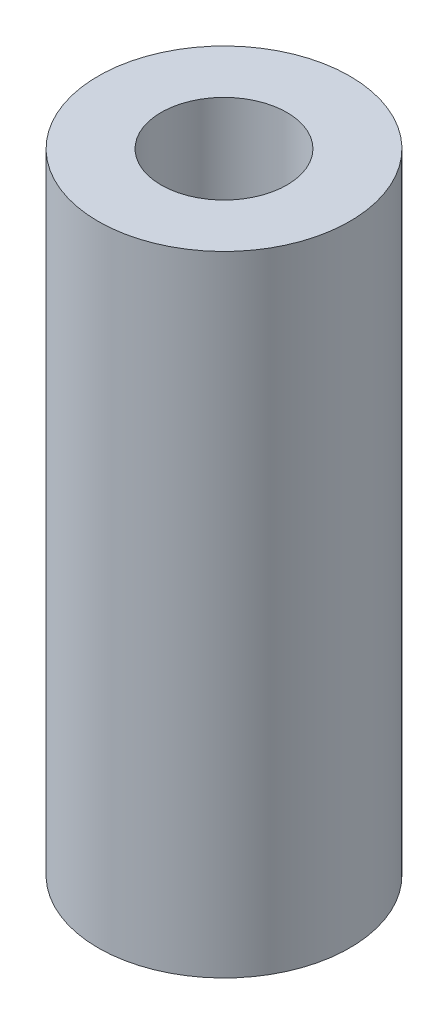
ISO-10303-21;
HEADER;
FILE_DESCRIPTION(('STEP AP214'),'2;1');
FILE_NAME('part.step','',(''),(''),'','','');
FILE_SCHEMA(('AUTOMOTIVE_DESIGN { 1 0 10303 214 1 1 1 1 }'));
ENDSEC;
DATA;
#1=APPLICATION_CONTEXT('core data for automotive mechanical design processes');
#2=APPLICATION_PROTOCOL_DEFINITION('international standard','automotive_design',2000,#1);
#3=PRODUCT_CONTEXT('',#1,'mechanical');
#4=PRODUCT('Part','Part','',(#3));
#5=PRODUCT_RELATED_PRODUCT_CATEGORY('part','',(#4));
#6=PRODUCT_DEFINITION_FORMATION('','',#4);
#7=PRODUCT_DEFINITION_CONTEXT('part definition',#1,'design');
#8=PRODUCT_DEFINITION('design','',#6,#7);
#9=PRODUCT_DEFINITION_SHAPE('','',#8);
#10=(LENGTH_UNIT() NAMED_UNIT(*) SI_UNIT(.MILLI.,.METRE.));
#11=(NAMED_UNIT(*) PLANE_ANGLE_UNIT() SI_UNIT($,.RADIAN.));
#12=(NAMED_UNIT(*) SI_UNIT($,.STERADIAN.) SOLID_ANGLE_UNIT());
#13=UNCERTAINTY_MEASURE_WITH_UNIT(LENGTH_MEASURE(1.E-05),#10,'distance_accuracy_value','');
#14=(GEOMETRIC_REPRESENTATION_CONTEXT(3) GLOBAL_UNCERTAINTY_ASSIGNED_CONTEXT((#13)) GLOBAL_UNIT_ASSIGNED_CONTEXT((#10,
#11,#12)) REPRESENTATION_CONTEXT('',''));
#15=CARTESIAN_POINT('',(0.,0.,0.));
#16=DIRECTION('',(0.,0.,1.));
#17=DIRECTION('',(1.,0.,0.));
#18=AXIS2_PLACEMENT_3D('',#15,#16,#17);
#19=CARTESIAN_POINT('',(0.,35.,0.));
#20=DIRECTION('',(0.,1.,0.));
#21=DIRECTION('',(0.,0.,1.));
#22=AXIS2_PLACEMENT_3D('',#19,#20,#21);
#23=PLANE('',#22);
#24=CARTESIAN_POINT('',(0.,35.,0.));
#25=DIRECTION('',(0.,1.,0.));
#26=DIRECTION('',(0.,0.,1.));
#27=AXIS2_PLACEMENT_3D('',#24,#25,#26);
#28=CIRCLE('',#27,7.);
#29=CARTESIAN_POINT('',(0.,35.,7.));
#30=VERTEX_POINT('',#29);
#31=EDGE_CURVE('E10',#30,#30,#28,.T.);
#32=ORIENTED_EDGE('',*,*,#31,.T.);
#33=EDGE_LOOP('',(#32));
#34=FACE_BOUND('',#33,.T.);
#35=CARTESIAN_POINT('',(0.,35.,0.));
#36=DIRECTION('',(0.,1.,0.));
#37=DIRECTION('',(0.,0.,1.));
#38=AXIS2_PLACEMENT_3D('',#35,#36,#37);
#39=CIRCLE('',#38,3.5);
#40=CARTESIAN_POINT('',(0.,35.,3.5));
#41=VERTEX_POINT('',#40);
#42=EDGE_CURVE('E50',#41,#41,#39,.T.);
#43=ORIENTED_EDGE('',*,*,#42,.F.);
#44=EDGE_LOOP('',(#43));
#45=FACE_BOUND('',#44,.T.);
#46=ADVANCED_FACE('F37',(#34,#45),#23,.T.);
#47=CARTESIAN_POINT('',(0.,0.,0.));
#48=DIRECTION('',(0.,1.,0.));
#49=DIRECTION('',(0.,0.,1.));
#50=AXIS2_PLACEMENT_3D('',#47,#48,#49);
#51=PLANE('',#50);
#52=CARTESIAN_POINT('',(0.,0.,0.));
#53=DIRECTION('',(0.,1.,0.));
#54=DIRECTION('',(0.,0.,1.));
#55=AXIS2_PLACEMENT_3D('',#52,#53,#54);
#56=CIRCLE('',#55,7.);
#57=CARTESIAN_POINT('',(0.,0.,7.));
#58=VERTEX_POINT('',#57);
#59=EDGE_CURVE('E41',#58,#58,#56,.T.);
#60=ORIENTED_EDGE('',*,*,#59,.F.);
#61=EDGE_LOOP('',(#60));
#62=FACE_BOUND('',#61,.T.);
#63=CARTESIAN_POINT('',(0.,0.,0.));
#64=DIRECTION('',(0.,1.,0.));
#65=DIRECTION('',(0.,0.,1.));
#66=AXIS2_PLACEMENT_3D('',#63,#64,#65);
#67=CIRCLE('',#66,3.5);
#68=CARTESIAN_POINT('',(0.,0.,3.5));
#69=VERTEX_POINT('',#68);
#70=EDGE_CURVE('E52',#69,#69,#67,.T.);
#71=ORIENTED_EDGE('',*,*,#70,.T.);
#72=EDGE_LOOP('',(#71));
#73=FACE_BOUND('',#72,.T.);
#74=ADVANCED_FACE('F64',(#62,#73),#51,.F.);
#75=CARTESIAN_POINT('',(0.,35.,0.));
#76=DIRECTION('',(0.,-1.,0.));
#77=DIRECTION('',(0.,0.,-1.));
#78=AXIS2_PLACEMENT_3D('',#75,#76,#77);
#79=CYLINDRICAL_SURFACE('',#78,7.);
#80=ORIENTED_EDGE('',*,*,#31,.F.);
#81=EDGE_LOOP('',(#80));
#82=FACE_BOUND('',#81,.T.);
#83=ORIENTED_EDGE('',*,*,#59,.T.);
#84=EDGE_LOOP('',(#83));
#85=FACE_BOUND('',#84,.T.);
#86=ADVANCED_FACE('F39',(#82,#85),#79,.T.);
#87=CARTESIAN_POINT('',(0.,35.,0.));
#88=DIRECTION('',(0.,-1.,0.));
#89=DIRECTION('',(0.,0.,-1.));
#90=AXIS2_PLACEMENT_3D('',#87,#88,#89);
#91=CYLINDRICAL_SURFACE('',#90,3.5);
#92=ORIENTED_EDGE('',*,*,#42,.T.);
#93=EDGE_LOOP('',(#92));
#94=FACE_BOUND('',#93,.T.);
#95=ORIENTED_EDGE('',*,*,#70,.F.);
#96=EDGE_LOOP('',(#95));
#97=FACE_BOUND('',#96,.T.);
#98=ADVANCED_FACE('F60',(#94,#97),#91,.F.);
#99=CLOSED_SHELL('',(#46,#74,#86,#98));
#100=MANIFOLD_SOLID_BREP('B2',#99);
#101=ADVANCED_BREP_SHAPE_REPRESENTATION('',(#18,#100),#14);
#102=SHAPE_DEFINITION_REPRESENTATION(#9,#101);
ENDSEC;
END-ISO-10303-21;
